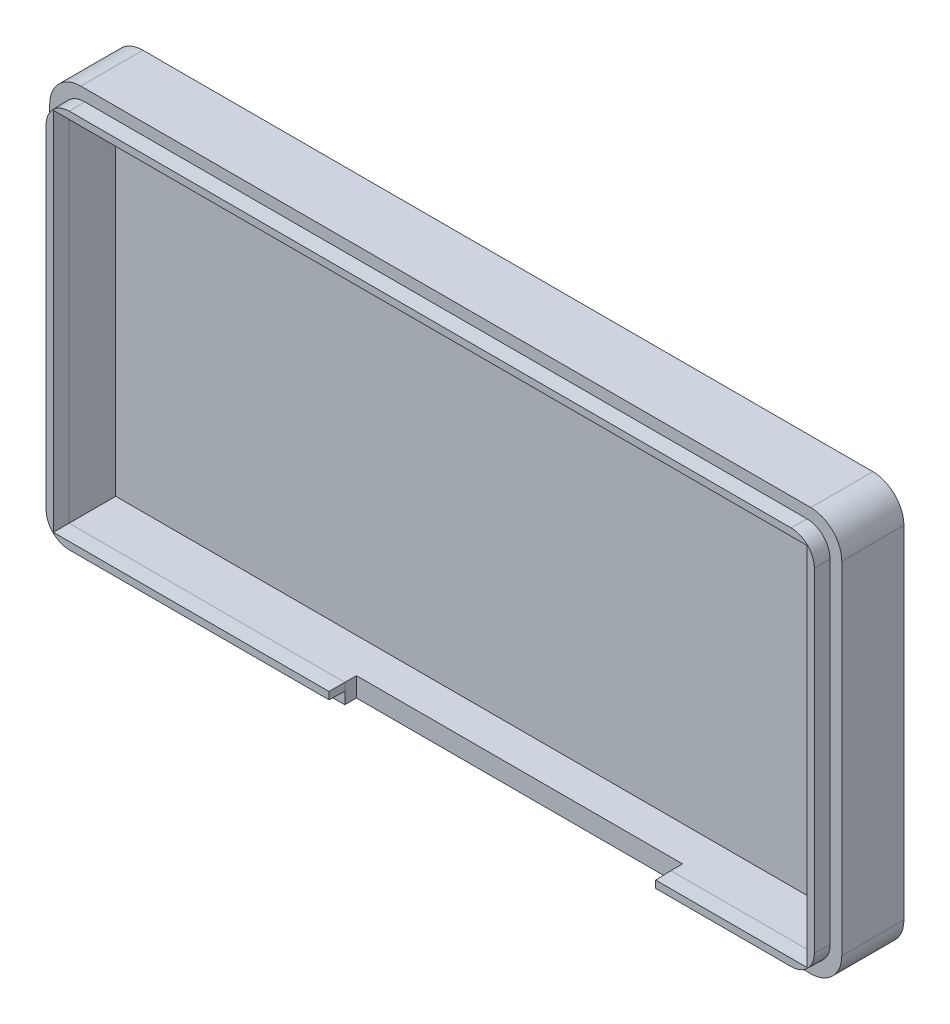
ISO-10303-21;
HEADER;
FILE_DESCRIPTION(('STEP AP214'),'2;1');
FILE_NAME('part.step','',(''),(''),'','','');
FILE_SCHEMA(('AUTOMOTIVE_DESIGN { 1 0 10303 214 1 1 1 1 }'));
ENDSEC;
DATA;
#1=APPLICATION_CONTEXT('core data for automotive mechanical design processes');
#2=APPLICATION_PROTOCOL_DEFINITION('international standard','automotive_design',2000,#1);
#3=PRODUCT_CONTEXT('',#1,'mechanical');
#4=PRODUCT('Part','Part','',(#3));
#5=PRODUCT_RELATED_PRODUCT_CATEGORY('part','',(#4));
#6=PRODUCT_DEFINITION_FORMATION('','',#4);
#7=PRODUCT_DEFINITION_CONTEXT('part definition',#1,'design');
#8=PRODUCT_DEFINITION('design','',#6,#7);
#9=PRODUCT_DEFINITION_SHAPE('','',#8);
#10=(LENGTH_UNIT() NAMED_UNIT(*) SI_UNIT(.MILLI.,.METRE.));
#11=(NAMED_UNIT(*) PLANE_ANGLE_UNIT() SI_UNIT($,.RADIAN.));
#12=(NAMED_UNIT(*) SI_UNIT($,.STERADIAN.) SOLID_ANGLE_UNIT());
#13=UNCERTAINTY_MEASURE_WITH_UNIT(LENGTH_MEASURE(1.E-05),#10,'distance_accuracy_value','');
#14=(GEOMETRIC_REPRESENTATION_CONTEXT(3) GLOBAL_UNCERTAINTY_ASSIGNED_CONTEXT((#13)) GLOBAL_UNIT_ASSIGNED_CONTEXT((#10,
#11,#12)) REPRESENTATION_CONTEXT('',''));
#15=CARTESIAN_POINT('',(0.,0.,0.));
#16=DIRECTION('',(0.,0.,1.));
#17=DIRECTION('',(1.,0.,0.));
#18=AXIS2_PLACEMENT_3D('',#15,#16,#17);
#19=CARTESIAN_POINT('',(0.,0.,8.));
#20=DIRECTION('',(0.,0.,1.));
#21=DIRECTION('',(1.,0.,0.));
#22=AXIS2_PLACEMENT_3D('',#19,#20,#21);
#23=PLANE('',#22);
#24=DIRECTION('',(0.,1.,0.));
#25=VECTOR('',#24,1.);
#26=CARTESIAN_POINT('',(38.,0.,8.));
#27=LINE('',#26,#25);
#28=CARTESIAN_POINT('',(38.,0.,8.));
#29=VERTEX_POINT('',#28);
#30=CARTESIAN_POINT('',(38.,1.5,8.));
#31=VERTEX_POINT('',#30);
#32=EDGE_CURVE('E426',#29,#31,#27,.T.);
#33=ORIENTED_EDGE('',*,*,#32,.T.);
#34=DIRECTION('',(1.,0.,0.));
#35=VECTOR('',#34,1.);
#36=CARTESIAN_POINT('',(38.,1.5,8.));
#37=LINE('',#36,#35);
#38=CARTESIAN_POINT('',(4.49954308546917,1.5,8.));
#39=VERTEX_POINT('',#38);
#40=EDGE_CURVE('E953',#31,#39,#37,.F.);
#41=ORIENTED_EDGE('',*,*,#40,.T.);
#42=CARTESIAN_POINT('',(4.50045698413172,4.50045698413172,8.));
#43=DIRECTION('',(0.,0.,1.));
#44=DIRECTION('',(-0.707106781186547,-0.707106781186548,0.));
#45=AXIS2_PLACEMENT_3D('',#42,#43,#44);
#46=ELLIPSE('',#45,3.00091389867315,3.);
#47=CARTESIAN_POINT('',(1.5,4.49954308546917,8.));
#48=VERTEX_POINT('',#47);
#49=EDGE_CURVE('E343',#39,#48,#46,.F.);
#50=ORIENTED_EDGE('',*,*,#49,.T.);
#51=DIRECTION('',(0.,1.,0.));
#52=VECTOR('',#51,1.);
#53=CARTESIAN_POINT('',(1.5,2.5,8.));
#54=LINE('',#53,#52);
#55=CARTESIAN_POINT('',(1.49999999999997,47.5004569145308,8.));
#56=VERTEX_POINT('',#55);
#57=EDGE_CURVE('E956',#48,#56,#54,.T.);
#58=ORIENTED_EDGE('',*,*,#57,.T.);
#59=CARTESIAN_POINT('',(4.5004569841317,47.4995430158683,8.));
#60=DIRECTION('',(0.,0.,1.));
#61=DIRECTION('',(-0.707106781186548,0.707106781186547,0.));
#62=AXIS2_PLACEMENT_3D('',#59,#60,#61);
#63=ELLIPSE('',#62,3.00091389867315,3.);
#64=CARTESIAN_POINT('',(4.49954308546915,50.5,8.));
#65=VERTEX_POINT('',#64);
#66=EDGE_CURVE('E346',#56,#65,#63,.F.);
#67=ORIENTED_EDGE('',*,*,#66,.T.);
#68=DIRECTION('',(1.,0.,0.));
#69=VECTOR('',#68,1.);
#70=CARTESIAN_POINT('',(2.49999999999997,50.5,8.));
#71=LINE('',#70,#69);
#72=CARTESIAN_POINT('',(97.5004569145308,50.5,8.));
#73=VERTEX_POINT('',#72);
#74=EDGE_CURVE('E354',#65,#73,#71,.T.);
#75=ORIENTED_EDGE('',*,*,#74,.T.);
#76=CARTESIAN_POINT('',(97.4995430158683,47.4995430158683,8.));
#77=DIRECTION('',(0.,0.,1.));
#78=DIRECTION('',(0.707106781186547,0.707106781186548,0.));
#79=AXIS2_PLACEMENT_3D('',#76,#77,#78);
#80=ELLIPSE('',#79,3.00091389867315,3.);
#81=CARTESIAN_POINT('',(100.5,47.5004569145308,8.));
#82=VERTEX_POINT('',#81);
#83=EDGE_CURVE('E72',#73,#82,#80,.F.);
#84=ORIENTED_EDGE('',*,*,#83,.T.);
#85=DIRECTION('',(0.,-1.,0.));
#86=VECTOR('',#85,1.);
#87=CARTESIAN_POINT('',(100.5,49.5,8.));
#88=LINE('',#87,#86);
#89=CARTESIAN_POINT('',(100.5,4.49954308546917,8.));
#90=VERTEX_POINT('',#89);
#91=EDGE_CURVE('E352',#82,#90,#88,.T.);
#92=ORIENTED_EDGE('',*,*,#91,.T.);
#93=CARTESIAN_POINT('',(97.4995430158683,4.50045698413173,8.));
#94=DIRECTION('',(0.,0.,1.));
#95=DIRECTION('',(0.707106781186548,-0.707106781186547,0.));
#96=AXIS2_PLACEMENT_3D('',#93,#94,#95);
#97=ELLIPSE('',#96,3.00091389867315,3.);
#98=CARTESIAN_POINT('',(97.5004569145308,1.5,8.));
#99=VERTEX_POINT('',#98);
#100=EDGE_CURVE('E12',#90,#99,#97,.F.);
#101=ORIENTED_EDGE('',*,*,#100,.T.);
#102=DIRECTION('',(1.,0.,0.));
#103=VECTOR('',#102,1.);
#104=CARTESIAN_POINT('',(99.5,1.5,8.));
#105=LINE('',#104,#103);
#106=CARTESIAN_POINT('',(80.,1.5,8.));
#107=VERTEX_POINT('',#106);
#108=EDGE_CURVE('E363',#99,#107,#105,.F.);
#109=ORIENTED_EDGE('',*,*,#108,.T.);
#110=DIRECTION('',(0.,-1.,0.));
#111=VECTOR('',#110,1.);
#112=CARTESIAN_POINT('',(80.,0.,8.));
#113=LINE('',#112,#111);
#114=CARTESIAN_POINT('',(80.,0.,8.));
#115=VERTEX_POINT('',#114);
#116=EDGE_CURVE('E288',#107,#115,#113,.T.);
#117=ORIENTED_EDGE('',*,*,#116,.T.);
#118=DIRECTION('',(1.,0.,0.));
#119=VECTOR('',#118,1.);
#120=CARTESIAN_POINT('',(0.,0.,8.));
#121=LINE('',#120,#119);
#122=CARTESIAN_POINT('',(98.,0.,8.));
#123=VERTEX_POINT('',#122);
#124=EDGE_CURVE('E478',#115,#123,#121,.T.);
#125=ORIENTED_EDGE('',*,*,#124,.T.);
#126=CARTESIAN_POINT('',(98.,4.,8.));
#127=DIRECTION('',(0.,0.,1.));
#128=DIRECTION('',(1.,0.,0.));
#129=AXIS2_PLACEMENT_3D('',#126,#127,#128);
#130=CIRCLE('',#129,4.);
#131=CARTESIAN_POINT('',(102.,4.,8.));
#132=VERTEX_POINT('',#131);
#133=EDGE_CURVE('E529',#123,#132,#130,.T.);
#134=ORIENTED_EDGE('',*,*,#133,.T.);
#135=DIRECTION('',(0.,1.,0.));
#136=VECTOR('',#135,1.);
#137=CARTESIAN_POINT('',(102.,0.,8.));
#138=LINE('',#137,#136);
#139=CARTESIAN_POINT('',(102.,48.,8.));
#140=VERTEX_POINT('',#139);
#141=EDGE_CURVE('E483',#132,#140,#138,.T.);
#142=ORIENTED_EDGE('',*,*,#141,.T.);
#143=CARTESIAN_POINT('',(98.,48.,8.));
#144=DIRECTION('',(0.,0.,1.));
#145=DIRECTION('',(1.,0.,0.));
#146=AXIS2_PLACEMENT_3D('',#143,#144,#145);
#147=CIRCLE('',#146,4.);
#148=CARTESIAN_POINT('',(98.,52.,8.));
#149=VERTEX_POINT('',#148);
#150=EDGE_CURVE('E538',#140,#149,#147,.T.);
#151=ORIENTED_EDGE('',*,*,#150,.T.);
#152=DIRECTION('',(-1.,0.,0.));
#153=VECTOR('',#152,1.);
#154=CARTESIAN_POINT('',(102.,52.,8.));
#155=LINE('',#154,#153);
#156=CARTESIAN_POINT('',(3.99999999999998,52.,8.));
#157=VERTEX_POINT('',#156);
#158=EDGE_CURVE('E470',#149,#157,#155,.T.);
#159=ORIENTED_EDGE('',*,*,#158,.T.);
#160=CARTESIAN_POINT('',(3.99999999999997,48.,8.));
#161=DIRECTION('',(0.,0.,1.));
#162=DIRECTION('',(1.,0.,0.));
#163=AXIS2_PLACEMENT_3D('',#160,#161,#162);
#164=CIRCLE('',#163,4.);
#165=CARTESIAN_POINT('',(0.,48.,8.));
#166=VERTEX_POINT('',#165);
#167=EDGE_CURVE('E535',#157,#166,#164,.T.);
#168=ORIENTED_EDGE('',*,*,#167,.T.);
#169=DIRECTION('',(0.,-1.,0.));
#170=VECTOR('',#169,1.);
#171=CARTESIAN_POINT('',(0.,52.,8.));
#172=LINE('',#171,#170);
#173=CARTESIAN_POINT('',(0.,4.00000000000001,8.));
#174=VERTEX_POINT('',#173);
#175=EDGE_CURVE('E474',#166,#174,#172,.T.);
#176=ORIENTED_EDGE('',*,*,#175,.T.);
#177=CARTESIAN_POINT('',(4.,4.,8.));
#178=DIRECTION('',(0.,0.,1.));
#179=DIRECTION('',(1.,0.,0.));
#180=AXIS2_PLACEMENT_3D('',#177,#178,#179);
#181=CIRCLE('',#180,4.);
#182=CARTESIAN_POINT('',(4.,0.,8.));
#183=VERTEX_POINT('',#182);
#184=EDGE_CURVE('E532',#174,#183,#181,.T.);
#185=ORIENTED_EDGE('',*,*,#184,.T.);
#186=EDGE_CURVE('E479',#183,#29,#121,.T.);
#187=ORIENTED_EDGE('',*,*,#186,.T.);
#188=EDGE_LOOP('',(#33,#41,#50,#58,#67,#75,#84,#92,#101,#109,#117,#125,#134,#142,#151,#159,#168,
#176,#185,#187));
#189=FACE_BOUND('',#188,.T.);
#190=ADVANCED_FACE('F63',(#189),#23,.T.);
#191=CARTESIAN_POINT('',(0.,0.,2.));
#192=DIRECTION('',(0.,1.,0.));
#193=DIRECTION('',(0.,0.,1.));
#194=AXIS2_PLACEMENT_3D('',#191,#192,#193);
#195=PLANE('',#194);
#196=DIRECTION('',(0.,0.,-1.));
#197=VECTOR('',#196,1.);
#198=CARTESIAN_POINT('',(80.,0.,29.3243963807178));
#199=LINE('',#198,#197);
#200=CARTESIAN_POINT('',(80.,0.,6.5));
#201=VERTEX_POINT('',#200);
#202=EDGE_CURVE('E266',#115,#201,#199,.T.);
#203=ORIENTED_EDGE('',*,*,#202,.T.);
#204=DIRECTION('',(-1.,0.,0.));
#205=VECTOR('',#204,1.);
#206=CARTESIAN_POINT('',(80.,0.,6.5));
#207=LINE('',#206,#205);
#208=CARTESIAN_POINT('',(38.,0.,6.5));
#209=VERTEX_POINT('',#208);
#210=EDGE_CURVE('E412',#201,#209,#207,.T.);
#211=ORIENTED_EDGE('',*,*,#210,.T.);
#212=DIRECTION('',(0.,0.,1.));
#213=VECTOR('',#212,1.);
#214=CARTESIAN_POINT('',(38.,0.,29.3243963807178));
#215=LINE('',#214,#213);
#216=EDGE_CURVE('E416',#209,#29,#215,.T.);
#217=ORIENTED_EDGE('',*,*,#216,.T.);
#218=ORIENTED_EDGE('',*,*,#186,.F.);
#219=DIRECTION('',(0.,0.,-1.));
#220=VECTOR('',#219,1.);
#221=CARTESIAN_POINT('',(4.,0.,2.));
#222=LINE('',#221,#220);
#223=CARTESIAN_POINT('',(4.,0.,0.));
#224=VERTEX_POINT('',#223);
#225=EDGE_CURVE('E552',#183,#224,#222,.T.);
#226=ORIENTED_EDGE('',*,*,#225,.T.);
#227=DIRECTION('',(1.,0.,0.));
#228=VECTOR('',#227,1.);
#229=CARTESIAN_POINT('',(0.,0.,0.));
#230=LINE('',#229,#228);
#231=CARTESIAN_POINT('',(98.,0.,0.));
#232=VERTEX_POINT('',#231);
#233=EDGE_CURVE('E491',#224,#232,#230,.T.);
#234=ORIENTED_EDGE('',*,*,#233,.T.);
#235=DIRECTION('',(0.,0.,-1.));
#236=VECTOR('',#235,1.);
#237=CARTESIAN_POINT('',(98.,0.,2.));
#238=LINE('',#237,#236);
#239=EDGE_CURVE('E548',#232,#123,#238,.F.);
#240=ORIENTED_EDGE('',*,*,#239,.T.);
#241=ORIENTED_EDGE('',*,*,#124,.F.);
#242=EDGE_LOOP('',(#203,#211,#217,#218,#226,#234,#240,#241));
#243=FACE_BOUND('',#242,.T.);
#244=ADVANCED_FACE('F569',(#243),#195,.F.);
#245=CARTESIAN_POINT('',(0.,2.5,8.));
#246=DIRECTION('',(0.,1.,0.));
#247=DIRECTION('',(0.,0.,1.));
#248=AXIS2_PLACEMENT_3D('',#245,#246,#247);
#249=PLANE('',#248);
#250=DIRECTION('',(1.,0.,0.));
#251=VECTOR('',#250,1.);
#252=CARTESIAN_POINT('',(0.,2.5,6.5));
#253=LINE('',#252,#251);
#254=CARTESIAN_POINT('',(38.,2.5,6.5));
#255=VERTEX_POINT('',#254);
#256=CARTESIAN_POINT('',(80.,2.5,6.5));
#257=VERTEX_POINT('',#256);
#258=EDGE_CURVE('E296',#255,#257,#253,.T.);
#259=ORIENTED_EDGE('',*,*,#258,.T.);
#260=DIRECTION('',(0.,0.,1.));
#261=VECTOR('',#260,1.);
#262=CARTESIAN_POINT('',(80.,2.5,8.));
#263=LINE('',#262,#261);
#264=CARTESIAN_POINT('',(80.,2.5,8.));
#265=VERTEX_POINT('',#264);
#266=EDGE_CURVE('E285',#257,#265,#263,.T.);
#267=ORIENTED_EDGE('',*,*,#266,.T.);
#268=DIRECTION('',(1.,0.,0.));
#269=VECTOR('',#268,1.);
#270=CARTESIAN_POINT('',(0.,2.5,8.));
#271=LINE('',#270,#269);
#272=CARTESIAN_POINT('',(99.5,2.5,8.));
#273=VERTEX_POINT('',#272);
#274=EDGE_CURVE('E271',#265,#273,#271,.T.);
#275=ORIENTED_EDGE('',*,*,#274,.T.);
#276=DIRECTION('',(0.,0.,-1.));
#277=VECTOR('',#276,1.);
#278=CARTESIAN_POINT('',(99.5,2.5,8.));
#279=LINE('',#278,#277);
#280=CARTESIAN_POINT('',(99.5,2.5,2.));
#281=VERTEX_POINT('',#280);
#282=EDGE_CURVE('E460',#273,#281,#279,.T.);
#283=ORIENTED_EDGE('',*,*,#282,.T.);
#284=DIRECTION('',(1.,0.,0.));
#285=VECTOR('',#284,1.);
#286=CARTESIAN_POINT('',(0.,2.5,2.));
#287=LINE('',#286,#285);
#288=CARTESIAN_POINT('',(2.5,2.5,2.));
#289=VERTEX_POINT('',#288);
#290=EDGE_CURVE('E451',#289,#281,#287,.T.);
#291=ORIENTED_EDGE('',*,*,#290,.F.);
#292=DIRECTION('',(0.,0.,-1.));
#293=VECTOR('',#292,1.);
#294=CARTESIAN_POINT('',(2.5,2.5,8.));
#295=LINE('',#294,#293);
#296=CARTESIAN_POINT('',(2.5,2.5,8.));
#297=VERTEX_POINT('',#296);
#298=EDGE_CURVE('E463',#297,#289,#295,.T.);
#299=ORIENTED_EDGE('',*,*,#298,.F.);
#300=CARTESIAN_POINT('',(38.,2.5,8.));
#301=VERTEX_POINT('',#300);
#302=EDGE_CURVE('E279',#297,#301,#271,.T.);
#303=ORIENTED_EDGE('',*,*,#302,.T.);
#304=DIRECTION('',(0.,0.,-1.));
#305=VECTOR('',#304,1.);
#306=CARTESIAN_POINT('',(38.,2.5,8.));
#307=LINE('',#306,#305);
#308=EDGE_CURVE('E305',#301,#255,#307,.T.);
#309=ORIENTED_EDGE('',*,*,#308,.T.);
#310=EDGE_LOOP('',(#259,#267,#275,#283,#291,#299,#303,#309));
#311=FACE_BOUND('',#310,.T.);
#312=ADVANCED_FACE('F293',(#311),#249,.T.);
#313=CARTESIAN_POINT('',(0.,0.,2.));
#314=DIRECTION('',(1.,0.,0.));
#315=DIRECTION('',(0.,1.,0.));
#316=AXIS2_PLACEMENT_3D('',#313,#314,#315);
#317=PLANE('',#316);
#318=ORIENTED_EDGE('',*,*,#175,.F.);
#319=DIRECTION('',(0.,0.,-1.));
#320=VECTOR('',#319,1.);
#321=CARTESIAN_POINT('',(0.,48.,2.));
#322=LINE('',#321,#320);
#323=CARTESIAN_POINT('',(0.,48.,0.));
#324=VERTEX_POINT('',#323);
#325=EDGE_CURVE('E544',#166,#324,#322,.T.);
#326=ORIENTED_EDGE('',*,*,#325,.T.);
#327=DIRECTION('',(0.,-1.,0.));
#328=VECTOR('',#327,1.);
#329=CARTESIAN_POINT('',(0.,0.,0.));
#330=LINE('',#329,#328);
#331=CARTESIAN_POINT('',(0.,4.,0.));
#332=VERTEX_POINT('',#331);
#333=EDGE_CURVE('E487',#324,#332,#330,.T.);
#334=ORIENTED_EDGE('',*,*,#333,.T.);
#335=DIRECTION('',(0.,0.,-1.));
#336=VECTOR('',#335,1.);
#337=CARTESIAN_POINT('',(0.,4.,2.));
#338=LINE('',#337,#336);
#339=EDGE_CURVE('E541',#332,#174,#338,.F.);
#340=ORIENTED_EDGE('',*,*,#339,.T.);
#341=EDGE_LOOP('',(#318,#326,#334,#340));
#342=FACE_BOUND('',#341,.T.);
#343=ADVANCED_FACE('F663',(#342),#317,.F.);
#344=CARTESIAN_POINT('',(102.,0.,2.));
#345=DIRECTION('',(-1.,0.,0.));
#346=DIRECTION('',(0.,-1.,0.));
#347=AXIS2_PLACEMENT_3D('',#344,#345,#346);
#348=PLANE('',#347);
#349=DIRECTION('',(0.,1.,0.));
#350=VECTOR('',#349,1.);
#351=CARTESIAN_POINT('',(102.,0.,0.));
#352=LINE('',#351,#350);
#353=CARTESIAN_POINT('',(102.,4.,0.));
#354=VERTEX_POINT('',#353);
#355=CARTESIAN_POINT('',(102.,48.,0.));
#356=VERTEX_POINT('',#355);
#357=EDGE_CURVE('E495',#354,#356,#352,.T.);
#358=ORIENTED_EDGE('',*,*,#357,.T.);
#359=DIRECTION('',(0.,0.,-1.));
#360=VECTOR('',#359,1.);
#361=CARTESIAN_POINT('',(102.,48.,2.));
#362=LINE('',#361,#360);
#363=EDGE_CURVE('E526',#356,#140,#362,.F.);
#364=ORIENTED_EDGE('',*,*,#363,.T.);
#365=ORIENTED_EDGE('',*,*,#141,.F.);
#366=DIRECTION('',(0.,0.,-1.));
#367=VECTOR('',#366,1.);
#368=CARTESIAN_POINT('',(102.,4.,2.));
#369=LINE('',#368,#367);
#370=EDGE_CURVE('E522',#132,#354,#369,.T.);
#371=ORIENTED_EDGE('',*,*,#370,.T.);
#372=EDGE_LOOP('',(#358,#364,#365,#371));
#373=FACE_BOUND('',#372,.T.);
#374=ADVANCED_FACE('F660',(#373),#348,.F.);
#375=CARTESIAN_POINT('',(0.,52.,2.));
#376=DIRECTION('',(0.,-1.,0.));
#377=DIRECTION('',(0.,0.,-1.));
#378=AXIS2_PLACEMENT_3D('',#375,#376,#377);
#379=PLANE('',#378);
#380=ORIENTED_EDGE('',*,*,#158,.F.);
#381=DIRECTION('',(0.,0.,-1.));
#382=VECTOR('',#381,1.);
#383=CARTESIAN_POINT('',(98.,52.,2.));
#384=LINE('',#383,#382);
#385=CARTESIAN_POINT('',(98.,52.,0.));
#386=VERTEX_POINT('',#385);
#387=EDGE_CURVE('E506',#149,#386,#384,.T.);
#388=ORIENTED_EDGE('',*,*,#387,.T.);
#389=DIRECTION('',(-1.,0.,0.));
#390=VECTOR('',#389,1.);
#391=CARTESIAN_POINT('',(0.,52.,0.));
#392=LINE('',#391,#390);
#393=CARTESIAN_POINT('',(3.99999999999997,52.,0.));
#394=VERTEX_POINT('',#393);
#395=EDGE_CURVE('E499',#386,#394,#392,.T.);
#396=ORIENTED_EDGE('',*,*,#395,.T.);
#397=DIRECTION('',(0.,0.,-1.));
#398=VECTOR('',#397,1.);
#399=CARTESIAN_POINT('',(3.99999999999997,52.,2.));
#400=LINE('',#399,#398);
#401=EDGE_CURVE('E503',#394,#157,#400,.F.);
#402=ORIENTED_EDGE('',*,*,#401,.T.);
#403=EDGE_LOOP('',(#380,#388,#396,#402));
#404=FACE_BOUND('',#403,.T.);
#405=ADVANCED_FACE('F656',(#404),#379,.F.);
#406=CARTESIAN_POINT('',(0.,0.,0.));
#407=DIRECTION('',(0.,0.,-1.));
#408=DIRECTION('',(-1.,0.,0.));
#409=AXIS2_PLACEMENT_3D('',#406,#407,#408);
#410=PLANE('',#409);
#411=ORIENTED_EDGE('',*,*,#395,.F.);
#412=CARTESIAN_POINT('',(98.,48.,0.));
#413=DIRECTION('',(0.,0.,-1.));
#414=DIRECTION('',(-1.,0.,0.));
#415=AXIS2_PLACEMENT_3D('',#412,#413,#414);
#416=CIRCLE('',#415,4.);
#417=EDGE_CURVE('E519',#386,#356,#416,.T.);
#418=ORIENTED_EDGE('',*,*,#417,.T.);
#419=ORIENTED_EDGE('',*,*,#357,.F.);
#420=CARTESIAN_POINT('',(98.,4.,0.));
#421=DIRECTION('',(0.,0.,-1.));
#422=DIRECTION('',(-1.,0.,0.));
#423=AXIS2_PLACEMENT_3D('',#420,#421,#422);
#424=CIRCLE('',#423,4.);
#425=EDGE_CURVE('E510',#354,#232,#424,.T.);
#426=ORIENTED_EDGE('',*,*,#425,.T.);
#427=ORIENTED_EDGE('',*,*,#233,.F.);
#428=CARTESIAN_POINT('',(4.,4.,0.));
#429=DIRECTION('',(0.,0.,-1.));
#430=DIRECTION('',(-1.,0.,0.));
#431=AXIS2_PLACEMENT_3D('',#428,#429,#430);
#432=CIRCLE('',#431,4.);
#433=EDGE_CURVE('E513',#224,#332,#432,.T.);
#434=ORIENTED_EDGE('',*,*,#433,.T.);
#435=ORIENTED_EDGE('',*,*,#333,.F.);
#436=CARTESIAN_POINT('',(3.99999999999997,48.,0.));
#437=DIRECTION('',(0.,0.,-1.));
#438=DIRECTION('',(-1.,0.,0.));
#439=AXIS2_PLACEMENT_3D('',#436,#437,#438);
#440=CIRCLE('',#439,4.);
#441=EDGE_CURVE('E516',#324,#394,#440,.T.);
#442=ORIENTED_EDGE('',*,*,#441,.T.);
#443=EDGE_LOOP('',(#411,#418,#419,#426,#427,#434,#435,#442));
#444=FACE_BOUND('',#443,.T.);
#445=ADVANCED_FACE('F653',(#444),#410,.T.);
#446=CARTESIAN_POINT('',(102.,49.5,8.));
#447=DIRECTION('',(0.,-1.,0.));
#448=DIRECTION('',(0.,0.,-1.));
#449=AXIS2_PLACEMENT_3D('',#446,#447,#448);
#450=PLANE('',#449);
#451=DIRECTION('',(-1.,0.,0.));
#452=VECTOR('',#451,1.);
#453=CARTESIAN_POINT('',(102.,49.5,2.));
#454=LINE('',#453,#452);
#455=CARTESIAN_POINT('',(99.5,49.5,2.));
#456=VERTEX_POINT('',#455);
#457=CARTESIAN_POINT('',(2.49999999999997,49.5,2.));
#458=VERTEX_POINT('',#457);
#459=EDGE_CURVE('E290',#456,#458,#454,.T.);
#460=ORIENTED_EDGE('',*,*,#459,.F.);
#461=DIRECTION('',(0.,0.,-1.));
#462=VECTOR('',#461,1.);
#463=CARTESIAN_POINT('',(99.5,49.5,8.));
#464=LINE('',#463,#462);
#465=CARTESIAN_POINT('',(99.5,49.5,8.));
#466=VERTEX_POINT('',#465);
#467=EDGE_CURVE('E443',#466,#456,#464,.T.);
#468=ORIENTED_EDGE('',*,*,#467,.F.);
#469=DIRECTION('',(-1.,0.,0.));
#470=VECTOR('',#469,1.);
#471=CARTESIAN_POINT('',(102.,49.5,8.));
#472=LINE('',#471,#470);
#473=CARTESIAN_POINT('',(2.49999999999997,49.5,8.));
#474=VERTEX_POINT('',#473);
#475=EDGE_CURVE('E429',#466,#474,#472,.T.);
#476=ORIENTED_EDGE('',*,*,#475,.T.);
#477=DIRECTION('',(0.,0.,-1.));
#478=VECTOR('',#477,1.);
#479=CARTESIAN_POINT('',(2.49999999999997,49.5,8.));
#480=LINE('',#479,#478);
#481=EDGE_CURVE('E466',#474,#458,#480,.T.);
#482=ORIENTED_EDGE('',*,*,#481,.T.);
#483=EDGE_LOOP('',(#460,#468,#476,#482));
#484=FACE_BOUND('',#483,.T.);
#485=ADVANCED_FACE('F618',(#484),#450,.T.);
#486=CARTESIAN_POINT('',(2.49999999999997,52.,8.));
#487=DIRECTION('',(1.,0.,0.));
#488=DIRECTION('',(0.,1.,0.));
#489=AXIS2_PLACEMENT_3D('',#486,#487,#488);
#490=PLANE('',#489);
#491=DIRECTION('',(0.,-1.,0.));
#492=VECTOR('',#491,1.);
#493=CARTESIAN_POINT('',(2.49999999999997,52.,2.));
#494=LINE('',#493,#492);
#495=EDGE_CURVE('E447',#458,#289,#494,.T.);
#496=ORIENTED_EDGE('',*,*,#495,.F.);
#497=ORIENTED_EDGE('',*,*,#481,.F.);
#498=DIRECTION('',(0.,-1.,0.));
#499=VECTOR('',#498,1.);
#500=CARTESIAN_POINT('',(2.49999999999997,52.,8.));
#501=LINE('',#500,#499);
#502=EDGE_CURVE('E280',#474,#297,#501,.T.);
#503=ORIENTED_EDGE('',*,*,#502,.T.);
#504=ORIENTED_EDGE('',*,*,#298,.T.);
#505=EDGE_LOOP('',(#496,#497,#503,#504));
#506=FACE_BOUND('',#505,.T.);
#507=ADVANCED_FACE('F624',(#506),#490,.T.);
#508=CARTESIAN_POINT('',(99.5,0.,8.));
#509=DIRECTION('',(-1.,0.,0.));
#510=DIRECTION('',(0.,-1.,0.));
#511=AXIS2_PLACEMENT_3D('',#508,#509,#510);
#512=PLANE('',#511);
#513=DIRECTION('',(0.,1.,0.));
#514=VECTOR('',#513,1.);
#515=CARTESIAN_POINT('',(99.5,0.,2.));
#516=LINE('',#515,#514);
#517=EDGE_CURVE('E433',#281,#456,#516,.T.);
#518=ORIENTED_EDGE('',*,*,#517,.F.);
#519=ORIENTED_EDGE('',*,*,#282,.F.);
#520=DIRECTION('',(0.,1.,0.));
#521=VECTOR('',#520,1.);
#522=CARTESIAN_POINT('',(99.5,0.,8.));
#523=LINE('',#522,#521);
#524=EDGE_CURVE('E439',#273,#466,#523,.T.);
#525=ORIENTED_EDGE('',*,*,#524,.T.);
#526=ORIENTED_EDGE('',*,*,#467,.T.);
#527=EDGE_LOOP('',(#518,#519,#525,#526));
#528=FACE_BOUND('',#527,.T.);
#529=ADVANCED_FACE('F615',(#528),#512,.T.);
#530=CARTESIAN_POINT('',(0.,0.,2.));
#531=DIRECTION('',(0.,0.,-1.));
#532=DIRECTION('',(-1.,0.,0.));
#533=AXIS2_PLACEMENT_3D('',#530,#531,#532);
#534=PLANE('',#533);
#535=ORIENTED_EDGE('',*,*,#517,.T.);
#536=ORIENTED_EDGE('',*,*,#459,.T.);
#537=ORIENTED_EDGE('',*,*,#495,.T.);
#538=ORIENTED_EDGE('',*,*,#290,.T.);
#539=EDGE_LOOP('',(#535,#536,#537,#538));
#540=FACE_BOUND('',#539,.T.);
#541=ADVANCED_FACE('F621',(#540),#534,.F.);
#542=CARTESIAN_POINT('',(98.,48.,2.));
#543=DIRECTION('',(0.,0.,-1.));
#544=DIRECTION('',(-1.,0.,0.));
#545=AXIS2_PLACEMENT_3D('',#542,#543,#544);
#546=CYLINDRICAL_SURFACE('',#545,4.);
#547=ORIENTED_EDGE('',*,*,#150,.F.);
#548=ORIENTED_EDGE('',*,*,#363,.F.);
#549=ORIENTED_EDGE('',*,*,#417,.F.);
#550=ORIENTED_EDGE('',*,*,#387,.F.);
#551=EDGE_LOOP('',(#547,#548,#549,#550));
#552=FACE_BOUND('',#551,.T.);
#553=ADVANCED_FACE('F652',(#552),#546,.T.);
#554=CARTESIAN_POINT('',(3.99999999999997,48.,2.));
#555=DIRECTION('',(0.,0.,-1.));
#556=DIRECTION('',(-1.,0.,0.));
#557=AXIS2_PLACEMENT_3D('',#554,#555,#556);
#558=CYLINDRICAL_SURFACE('',#557,4.);
#559=ORIENTED_EDGE('',*,*,#167,.F.);
#560=ORIENTED_EDGE('',*,*,#401,.F.);
#561=ORIENTED_EDGE('',*,*,#441,.F.);
#562=ORIENTED_EDGE('',*,*,#325,.F.);
#563=EDGE_LOOP('',(#559,#560,#561,#562));
#564=FACE_BOUND('',#563,.T.);
#565=ADVANCED_FACE('F671',(#564),#558,.T.);
#566=CARTESIAN_POINT('',(4.,4.,2.));
#567=DIRECTION('',(0.,0.,-1.));
#568=DIRECTION('',(-1.,0.,0.));
#569=AXIS2_PLACEMENT_3D('',#566,#567,#568);
#570=CYLINDRICAL_SURFACE('',#569,4.);
#571=ORIENTED_EDGE('',*,*,#184,.F.);
#572=ORIENTED_EDGE('',*,*,#339,.F.);
#573=ORIENTED_EDGE('',*,*,#433,.F.);
#574=ORIENTED_EDGE('',*,*,#225,.F.);
#575=EDGE_LOOP('',(#571,#572,#573,#574));
#576=FACE_BOUND('',#575,.T.);
#577=ADVANCED_FACE('F675',(#576),#570,.T.);
#578=CARTESIAN_POINT('',(98.,4.,2.));
#579=DIRECTION('',(0.,0.,-1.));
#580=DIRECTION('',(-1.,0.,0.));
#581=AXIS2_PLACEMENT_3D('',#578,#579,#580);
#582=CYLINDRICAL_SURFACE('',#581,4.);
#583=ORIENTED_EDGE('',*,*,#133,.F.);
#584=ORIENTED_EDGE('',*,*,#239,.F.);
#585=ORIENTED_EDGE('',*,*,#425,.F.);
#586=ORIENTED_EDGE('',*,*,#370,.F.);
#587=EDGE_LOOP('',(#583,#584,#585,#586));
#588=FACE_BOUND('',#587,.T.);
#589=ADVANCED_FACE('F679',(#588),#582,.T.);
#590=CARTESIAN_POINT('',(80.,14.,29.3243963807178));
#591=DIRECTION('',(-1.,0.,0.));
#592=DIRECTION('',(0.,0.,1.));
#593=AXIS2_PLACEMENT_3D('',#590,#591,#592);
#594=PLANE('',#593);
#595=ORIENTED_EDGE('',*,*,#266,.F.);
#596=DIRECTION('',(0.,-1.,0.));
#597=VECTOR('',#596,1.);
#598=CARTESIAN_POINT('',(80.,14.,6.5));
#599=LINE('',#598,#597);
#600=EDGE_CURVE('E423',#257,#201,#599,.T.);
#601=ORIENTED_EDGE('',*,*,#600,.T.);
#602=ORIENTED_EDGE('',*,*,#202,.F.);
#603=ORIENTED_EDGE('',*,*,#116,.F.);
#604=EDGE_CURVE('E259',#265,#107,#113,.T.);
#605=ORIENTED_EDGE('',*,*,#604,.F.);
#606=EDGE_LOOP('',(#595,#601,#602,#603,#605));
#607=FACE_BOUND('',#606,.T.);
#608=ADVANCED_FACE('F284',(#607),#594,.T.);
#609=CARTESIAN_POINT('',(80.,14.,6.5));
#610=DIRECTION('',(0.,0.,1.));
#611=DIRECTION('',(1.,0.,0.));
#612=AXIS2_PLACEMENT_3D('',#609,#610,#611);
#613=PLANE('',#612);
#614=DIRECTION('',(0.,-1.,0.));
#615=VECTOR('',#614,1.);
#616=CARTESIAN_POINT('',(38.,14.,6.5));
#617=LINE('',#616,#615);
#618=EDGE_CURVE('E420',#255,#209,#617,.T.);
#619=ORIENTED_EDGE('',*,*,#618,.T.);
#620=ORIENTED_EDGE('',*,*,#210,.F.);
#621=ORIENTED_EDGE('',*,*,#600,.F.);
#622=ORIENTED_EDGE('',*,*,#258,.F.);
#623=EDGE_LOOP('',(#619,#620,#621,#622));
#624=FACE_BOUND('',#623,.T.);
#625=ADVANCED_FACE('F566',(#624),#613,.T.);
#626=CARTESIAN_POINT('',(38.,14.,29.3243963807178));
#627=DIRECTION('',(1.,0.,0.));
#628=DIRECTION('',(0.,0.,-1.));
#629=AXIS2_PLACEMENT_3D('',#626,#627,#628);
#630=PLANE('',#629);
#631=ORIENTED_EDGE('',*,*,#216,.F.);
#632=ORIENTED_EDGE('',*,*,#618,.F.);
#633=ORIENTED_EDGE('',*,*,#308,.F.);
#634=DIRECTION('',(0.,-1.,0.));
#635=VECTOR('',#634,1.);
#636=CARTESIAN_POINT('',(38.,2.5,8.));
#637=LINE('',#636,#635);
#638=EDGE_CURVE('E563',#301,#31,#637,.T.);
#639=ORIENTED_EDGE('',*,*,#638,.T.);
#640=ORIENTED_EDGE('',*,*,#32,.F.);
#641=EDGE_LOOP('',(#631,#632,#633,#639,#640));
#642=FACE_BOUND('',#641,.T.);
#643=ADVANCED_FACE('F561',(#642),#630,.T.);
#644=CARTESIAN_POINT('',(99.5,2.5,8.));
#645=DIRECTION('',(0.,0.999847695156391,0.0174524064372835));
#646=DIRECTION('',(0.,-0.0174524064372835,0.999847695156391));
#647=AXIS2_PLACEMENT_3D('',#644,#645,#646);
#648=PLANE('',#647);
#649=ORIENTED_EDGE('',*,*,#274,.F.);
#650=DIRECTION('',(0.0174497491606827,-0.0174497491606827,0.999695459881887));
#651=VECTOR('',#650,1.);
#652=CARTESIAN_POINT('',(80.0059376280425,2.49406237195747,8.34016648273424));
#653=LINE('',#652,#651);
#654=CARTESIAN_POINT('',(80.0349101298564,2.46508987014357,10.));
#655=VERTEX_POINT('',#654);
#656=EDGE_CURVE('E254',#655,#265,#653,.F.);
#657=ORIENTED_EDGE('',*,*,#656,.F.);
#658=DIRECTION('',(1.,0.,0.));
#659=VECTOR('',#658,1.);
#660=CARTESIAN_POINT('',(0.,2.46508987014357,10.));
#661=LINE('',#660,#659);
#662=CARTESIAN_POINT('',(99.5349101298564,2.46508987014357,10.));
#663=VERTEX_POINT('',#662);
#664=EDGE_CURVE('E598',#663,#655,#661,.F.);
#665=ORIENTED_EDGE('',*,*,#664,.F.);
#666=DIRECTION('',(-0.0174497491606827,0.0174497491606827,-0.999695459881887));
#667=VECTOR('',#666,1.);
#668=CARTESIAN_POINT('',(99.4856887939488,2.51431120605122,7.18011155443542));
#669=LINE('',#668,#667);
#670=EDGE_CURVE('E274',#663,#273,#669,.T.);
#671=ORIENTED_EDGE('',*,*,#670,.T.);
#672=EDGE_LOOP('',(#649,#657,#665,#671));
#673=FACE_BOUND('',#672,.T.);
#674=ADVANCED_FACE('F272',(#673),#648,.T.);
#675=CARTESIAN_POINT('',(80.,1.5,8.));
#676=DIRECTION('',(-0.999847695156391,0.,0.0174524064372835));
#677=DIRECTION('',(0.0174524064372835,0.,0.999847695156391));
#678=AXIS2_PLACEMENT_3D('',#675,#676,#677);
#679=PLANE('',#678);
#680=ORIENTED_EDGE('',*,*,#604,.T.);
#681=DIRECTION('',(-0.0174497491606827,-0.0174497491606827,-0.999695459881887));
#682=VECTOR('',#681,1.);
#683=CARTESIAN_POINT('',(80.0059376280425,1.50593762804253,8.34016648273424));
#684=LINE('',#683,#682);
#685=CARTESIAN_POINT('',(80.0349101298564,1.53491012985644,10.));
#686=VERTEX_POINT('',#685);
#687=EDGE_CURVE('E267',#686,#107,#684,.T.);
#688=ORIENTED_EDGE('',*,*,#687,.F.);
#689=DIRECTION('',(0.,1.,0.));
#690=VECTOR('',#689,1.);
#691=CARTESIAN_POINT('',(80.0349101298564,0.,10.));
#692=LINE('',#691,#690);
#693=EDGE_CURVE('E262',#686,#655,#692,.T.);
#694=ORIENTED_EDGE('',*,*,#693,.T.);
#695=ORIENTED_EDGE('',*,*,#656,.T.);
#696=EDGE_LOOP('',(#680,#688,#694,#695));
#697=FACE_BOUND('',#696,.T.);
#698=ADVANCED_FACE('F256',(#697),#679,.T.);
#699=CARTESIAN_POINT('',(99.5,1.5,8.));
#700=DIRECTION('',(0.,-0.999847695156391,0.0174524064372835));
#701=DIRECTION('',(0.,-0.0174524064372835,-0.999847695156391));
#702=AXIS2_PLACEMENT_3D('',#699,#700,#701);
#703=PLANE('',#702);
#704=ORIENTED_EDGE('',*,*,#108,.F.);
#705=DIRECTION('',(0.0174497491606827,-0.0174497491606827,-0.999695459881888));
#706=VECTOR('',#705,1.);
#707=CARTESIAN_POINT('',(97.5010657628948,1.49939115163608,7.96511910059181));
#708=LINE('',#707,#706);
#709=CARTESIAN_POINT('',(97.4655467846744,1.53491012985644,10.));
#710=VERTEX_POINT('',#709);
#711=EDGE_CURVE('E340',#99,#710,#708,.F.);
#712=ORIENTED_EDGE('',*,*,#711,.T.);
#713=DIRECTION('',(-1.,0.,0.));
#714=VECTOR('',#713,1.);
#715=CARTESIAN_POINT('',(0.,1.53491012985644,10.));
#716=LINE('',#715,#714);
#717=EDGE_CURVE('E386',#710,#686,#716,.T.);
#718=ORIENTED_EDGE('',*,*,#717,.T.);
#719=ORIENTED_EDGE('',*,*,#687,.T.);
#720=EDGE_LOOP('',(#704,#712,#718,#719));
#721=FACE_BOUND('',#720,.T.);
#722=ADVANCED_FACE('F605',(#721),#703,.T.);
#723=CARTESIAN_POINT('',(100.5,49.5,8.));
#724=DIRECTION('',(0.999847695156391,0.,0.0174524064372835));
#725=DIRECTION('',(0.0174524064372835,0.,-0.999847695156391));
#726=AXIS2_PLACEMENT_3D('',#723,#724,#725);
#727=PLANE('',#726);
#728=ORIENTED_EDGE('',*,*,#91,.F.);
#729=DIRECTION('',(0.0174497491606827,0.0174497491606827,-0.999695459881888));
#730=VECTOR('',#729,1.);
#731=CARTESIAN_POINT('',(100.500608848364,47.5010657628947,7.96511910059181));
#732=LINE('',#731,#730);
#733=CARTESIAN_POINT('',(100.465089870144,47.4655467846744,10.));
#734=VERTEX_POINT('',#733);
#735=EDGE_CURVE('E337',#82,#734,#732,.F.);
#736=ORIENTED_EDGE('',*,*,#735,.T.);
#737=DIRECTION('',(0.,-1.,0.));
#738=VECTOR('',#737,1.);
#739=CARTESIAN_POINT('',(100.465089870144,0.,10.));
#740=LINE('',#739,#738);
#741=CARTESIAN_POINT('',(100.465089870144,4.53445321532561,10.));
#742=VERTEX_POINT('',#741);
#743=EDGE_CURVE('E374',#734,#742,#740,.T.);
#744=ORIENTED_EDGE('',*,*,#743,.T.);
#745=DIRECTION('',(0.0174497491606827,-0.0174497491606827,-0.999695459881888));
#746=VECTOR('',#745,1.);
#747=CARTESIAN_POINT('',(100.486297642313,4.51324544315648,8.78500754615639));
#748=LINE('',#747,#746);
#749=EDGE_CURVE('E334',#742,#90,#748,.T.);
#750=ORIENTED_EDGE('',*,*,#749,.T.);
#751=EDGE_LOOP('',(#728,#736,#744,#750));
#752=FACE_BOUND('',#751,.T.);
#753=ADVANCED_FACE('F359',(#752),#727,.T.);
#754=CARTESIAN_POINT('',(2.49999999999997,50.5,8.));
#755=DIRECTION('',(0.,0.999847695156391,0.0174524064372835));
#756=DIRECTION('',(0.,-0.0174524064372835,0.999847695156391));
#757=AXIS2_PLACEMENT_3D('',#754,#755,#756);
#758=PLANE('',#757);
#759=ORIENTED_EDGE('',*,*,#74,.F.);
#760=DIRECTION('',(-0.0174497491606827,0.0174497491606827,-0.999695459881888));
#761=VECTOR('',#760,1.);
#762=CARTESIAN_POINT('',(4.49893423710522,50.5006088483639,7.96511910059181));
#763=LINE('',#762,#761);
#764=CARTESIAN_POINT('',(4.53445321532558,50.4650898701436,10.));
#765=VERTEX_POINT('',#764);
#766=EDGE_CURVE('E331',#65,#765,#763,.F.);
#767=ORIENTED_EDGE('',*,*,#766,.T.);
#768=DIRECTION('',(1.,0.,0.));
#769=VECTOR('',#768,1.);
#770=CARTESIAN_POINT('',(0.,50.4650898701436,10.));
#771=LINE('',#770,#769);
#772=CARTESIAN_POINT('',(97.4655467846744,50.4650898701436,10.));
#773=VERTEX_POINT('',#772);
#774=EDGE_CURVE('E372',#765,#773,#771,.T.);
#775=ORIENTED_EDGE('',*,*,#774,.T.);
#776=DIRECTION('',(0.0174497491606827,0.0174497491606827,-0.999695459881888));
#777=VECTOR('',#776,1.);
#778=CARTESIAN_POINT('',(97.471529869555,50.4710729550242,9.65722929675701));
#779=LINE('',#778,#777);
#780=EDGE_CURVE('E327',#773,#73,#779,.T.);
#781=ORIENTED_EDGE('',*,*,#780,.T.);
#782=EDGE_LOOP('',(#759,#767,#775,#781));
#783=FACE_BOUND('',#782,.T.);
#784=ADVANCED_FACE('F376',(#783),#758,.T.);
#785=CARTESIAN_POINT('',(1.5,2.5,8.));
#786=DIRECTION('',(-0.999847695156391,0.,0.0174524064372835));
#787=DIRECTION('',(0.0174524064372835,0.,0.999847695156391));
#788=AXIS2_PLACEMENT_3D('',#785,#786,#787);
#789=PLANE('',#788);
#790=ORIENTED_EDGE('',*,*,#57,.F.);
#791=DIRECTION('',(-0.0174497491606827,-0.0174497491606827,-0.999695459881888));
#792=VECTOR('',#791,1.);
#793=CARTESIAN_POINT('',(1.49939115163607,4.49893423710525,7.96511910059181));
#794=LINE('',#793,#792);
#795=CARTESIAN_POINT('',(1.53491012985643,4.53445321532561,10.));
#796=VERTEX_POINT('',#795);
#797=EDGE_CURVE('E312',#48,#796,#794,.F.);
#798=ORIENTED_EDGE('',*,*,#797,.T.);
#799=DIRECTION('',(0.,1.,0.));
#800=VECTOR('',#799,1.);
#801=CARTESIAN_POINT('',(1.53491012985644,0.,10.));
#802=LINE('',#801,#800);
#803=CARTESIAN_POINT('',(1.53491012985641,47.4655467846744,10.));
#804=VERTEX_POINT('',#803);
#805=EDGE_CURVE('E379',#796,#804,#802,.T.);
#806=ORIENTED_EDGE('',*,*,#805,.T.);
#807=DIRECTION('',(-0.0174497491606827,0.0174497491606827,-0.999695459881888));
#808=VECTOR('',#807,1.);
#809=CARTESIAN_POINT('',(1.51370235768728,47.4867545568435,8.78500754615639));
#810=LINE('',#809,#808);
#811=EDGE_CURVE('E303',#804,#56,#810,.T.);
#812=ORIENTED_EDGE('',*,*,#811,.T.);
#813=EDGE_LOOP('',(#790,#798,#806,#812));
#814=FACE_BOUND('',#813,.T.);
#815=ADVANCED_FACE('F733',(#814),#789,.T.);
#816=CARTESIAN_POINT('',(38.,1.5,8.));
#817=DIRECTION('',(0.,-0.999847695156391,0.0174524064372835));
#818=DIRECTION('',(0.,-0.0174524064372835,-0.999847695156391));
#819=AXIS2_PLACEMENT_3D('',#816,#817,#818);
#820=PLANE('',#819);
#821=DIRECTION('',(-1.,0.,0.));
#822=VECTOR('',#821,1.);
#823=CARTESIAN_POINT('',(0.,1.53491012985644,10.));
#824=LINE('',#823,#822);
#825=CARTESIAN_POINT('',(37.9650898701436,1.53491012985644,10.));
#826=VERTEX_POINT('',#825);
#827=CARTESIAN_POINT('',(4.5344532153256,1.53491012985644,10.));
#828=VERTEX_POINT('',#827);
#829=EDGE_CURVE('E384',#826,#828,#824,.T.);
#830=ORIENTED_EDGE('',*,*,#829,.T.);
#831=DIRECTION('',(-0.0174497491606827,-0.0174497491606827,-0.999695459881888));
#832=VECTOR('',#831,1.);
#833=CARTESIAN_POINT('',(4.50974376508011,1.51020067961094,8.58439654351825));
#834=LINE('',#833,#832);
#835=EDGE_CURVE('E298',#828,#39,#834,.T.);
#836=ORIENTED_EDGE('',*,*,#835,.T.);
#837=ORIENTED_EDGE('',*,*,#40,.F.);
#838=DIRECTION('',(0.0174497491606827,-0.0174497491606827,-0.999695459881887));
#839=VECTOR('',#838,1.);
#840=CARTESIAN_POINT('',(37.9996955062542,1.50030449374577,8.01744443501201));
#841=LINE('',#840,#839);
#842=EDGE_CURVE('E576',#826,#31,#841,.T.);
#843=ORIENTED_EDGE('',*,*,#842,.F.);
#844=EDGE_LOOP('',(#830,#836,#837,#843));
#845=FACE_BOUND('',#844,.T.);
#846=ADVANCED_FACE('F727',(#845),#820,.T.);
#847=CARTESIAN_POINT('',(38.,2.5,8.));
#848=DIRECTION('',(0.999847695156391,0.,0.0174524064372835));
#849=DIRECTION('',(0.0174524064372835,0.,-0.999847695156391));
#850=AXIS2_PLACEMENT_3D('',#847,#848,#849);
#851=PLANE('',#850);
#852=ORIENTED_EDGE('',*,*,#638,.F.);
#853=DIRECTION('',(-0.0174497491606827,-0.0174497491606827,0.999695459881887));
#854=VECTOR('',#853,1.);
#855=CARTESIAN_POINT('',(38.,2.5,8.));
#856=LINE('',#855,#854);
#857=CARTESIAN_POINT('',(37.9650898701436,2.46508987014357,10.));
#858=VERTEX_POINT('',#857);
#859=EDGE_CURVE('E579',#858,#301,#856,.F.);
#860=ORIENTED_EDGE('',*,*,#859,.F.);
#861=DIRECTION('',(0.,-1.,0.));
#862=VECTOR('',#861,1.);
#863=CARTESIAN_POINT('',(37.9650898701436,0.,10.));
#864=LINE('',#863,#862);
#865=EDGE_CURVE('E393',#858,#826,#864,.T.);
#866=ORIENTED_EDGE('',*,*,#865,.T.);
#867=ORIENTED_EDGE('',*,*,#842,.T.);
#868=EDGE_LOOP('',(#852,#860,#866,#867));
#869=FACE_BOUND('',#868,.T.);
#870=ADVANCED_FACE('F732',(#869),#851,.T.);
#871=CARTESIAN_POINT('',(38.,2.5,8.));
#872=DIRECTION('',(0.,0.999847695156391,0.0174524064372835));
#873=DIRECTION('',(0.,-0.0174524064372835,0.999847695156391));
#874=AXIS2_PLACEMENT_3D('',#871,#872,#873);
#875=PLANE('',#874);
#876=ORIENTED_EDGE('',*,*,#302,.F.);
#877=DIRECTION('',(0.0174497491606827,0.0174497491606827,-0.999695459881887));
#878=VECTOR('',#877,1.);
#879=CARTESIAN_POINT('',(2.51080952797485,2.51080952797486,7.38072255707356));
#880=LINE('',#879,#878);
#881=CARTESIAN_POINT('',(2.46508987014356,2.46508987014357,10.));
#882=VERTEX_POINT('',#881);
#883=EDGE_CURVE('E582',#882,#297,#880,.T.);
#884=ORIENTED_EDGE('',*,*,#883,.F.);
#885=DIRECTION('',(1.,0.,0.));
#886=VECTOR('',#885,1.);
#887=CARTESIAN_POINT('',(0.,2.46508987014357,10.));
#888=LINE('',#887,#886);
#889=EDGE_CURVE('E397',#858,#882,#888,.F.);
#890=ORIENTED_EDGE('',*,*,#889,.F.);
#891=ORIENTED_EDGE('',*,*,#859,.T.);
#892=EDGE_LOOP('',(#876,#884,#890,#891));
#893=FACE_BOUND('',#892,.T.);
#894=ADVANCED_FACE('F639',(#893),#875,.T.);
#895=CARTESIAN_POINT('',(2.5,2.5,8.));
#896=DIRECTION('',(0.999847695156391,0.,0.0174524064372835));
#897=DIRECTION('',(0.0174524064372835,0.,-0.999847695156391));
#898=AXIS2_PLACEMENT_3D('',#895,#896,#897);
#899=PLANE('',#898);
#900=ORIENTED_EDGE('',*,*,#502,.F.);
#901=DIRECTION('',(0.0174497491606827,-0.0174497491606827,-0.999695459881887));
#902=VECTOR('',#901,1.);
#903=CARTESIAN_POINT('',(2.5143112060512,49.4856887939488,7.18011155443542));
#904=LINE('',#903,#902);
#905=CARTESIAN_POINT('',(2.46508987014354,49.5349101298564,10.));
#906=VERTEX_POINT('',#905);
#907=EDGE_CURVE('E586',#906,#474,#904,.T.);
#908=ORIENTED_EDGE('',*,*,#907,.F.);
#909=DIRECTION('',(0.,-1.,0.));
#910=VECTOR('',#909,1.);
#911=CARTESIAN_POINT('',(2.46508987014357,0.,10.));
#912=LINE('',#911,#910);
#913=EDGE_CURVE('E400',#882,#906,#912,.F.);
#914=ORIENTED_EDGE('',*,*,#913,.F.);
#915=ORIENTED_EDGE('',*,*,#883,.T.);
#916=EDGE_LOOP('',(#900,#908,#914,#915));
#917=FACE_BOUND('',#916,.T.);
#918=ADVANCED_FACE('F627',(#917),#899,.T.);
#919=CARTESIAN_POINT('',(2.49999999999997,49.5,8.));
#920=DIRECTION('',(0.,-0.999847695156391,0.0174524064372835));
#921=DIRECTION('',(0.,-0.0174524064372835,-0.999847695156391));
#922=AXIS2_PLACEMENT_3D('',#919,#920,#921);
#923=PLANE('',#922);
#924=ORIENTED_EDGE('',*,*,#475,.F.);
#925=DIRECTION('',(-0.0174497491606827,-0.0174497491606827,-0.999695459881887));
#926=VECTOR('',#925,1.);
#927=CARTESIAN_POINT('',(99.4704641066602,49.4704641066602,6.30788980383481));
#928=LINE('',#927,#926);
#929=CARTESIAN_POINT('',(99.5349101298564,49.5349101298564,10.));
#930=VERTEX_POINT('',#929);
#931=EDGE_CURVE('E590',#930,#466,#928,.T.);
#932=ORIENTED_EDGE('',*,*,#931,.F.);
#933=DIRECTION('',(-1.,0.,0.));
#934=VECTOR('',#933,1.);
#935=CARTESIAN_POINT('',(0.,49.5349101298564,10.));
#936=LINE('',#935,#934);
#937=EDGE_CURVE('E403',#906,#930,#936,.F.);
#938=ORIENTED_EDGE('',*,*,#937,.F.);
#939=ORIENTED_EDGE('',*,*,#907,.T.);
#940=EDGE_LOOP('',(#924,#932,#938,#939));
#941=FACE_BOUND('',#940,.T.);
#942=ADVANCED_FACE('F631',(#941),#923,.T.);
#943=CARTESIAN_POINT('',(99.5,49.5,8.));
#944=DIRECTION('',(-0.999847695156391,0.,0.0174524064372835));
#945=DIRECTION('',(0.0174524064372835,0.,0.999847695156391));
#946=AXIS2_PLACEMENT_3D('',#943,#944,#945);
#947=PLANE('',#946);
#948=ORIENTED_EDGE('',*,*,#524,.F.);
#949=ORIENTED_EDGE('',*,*,#670,.F.);
#950=DIRECTION('',(0.,1.,0.));
#951=VECTOR('',#950,1.);
#952=CARTESIAN_POINT('',(99.5349101298564,0.,10.));
#953=LINE('',#952,#951);
#954=EDGE_CURVE('E406',#930,#663,#953,.F.);
#955=ORIENTED_EDGE('',*,*,#954,.F.);
#956=ORIENTED_EDGE('',*,*,#931,.T.);
#957=EDGE_LOOP('',(#948,#949,#955,#956));
#958=FACE_BOUND('',#957,.T.);
#959=ADVANCED_FACE('F611',(#958),#947,.T.);
#960=CARTESIAN_POINT('',(0.,0.,10.));
#961=DIRECTION('',(0.,0.,-1.));
#962=DIRECTION('',(-1.,0.,0.));
#963=AXIS2_PLACEMENT_3D('',#960,#961,#962);
#964=PLANE('',#963);
#965=ORIENTED_EDGE('',*,*,#805,.F.);
#966=CARTESIAN_POINT('',(4.53536711398815,4.53536711398816,10.));
#967=DIRECTION('',(0.,0.,-1.));
#968=DIRECTION('',(-0.707106781186547,-0.707106781186548,0.));
#969=AXIS2_PLACEMENT_3D('',#966,#967,#968);
#970=ELLIPSE('',#969,3.00091389867315,3.);
#971=EDGE_CURVE('E324',#796,#828,#970,.F.);
#972=ORIENTED_EDGE('',*,*,#971,.T.);
#973=ORIENTED_EDGE('',*,*,#829,.F.);
#974=ORIENTED_EDGE('',*,*,#865,.F.);
#975=ORIENTED_EDGE('',*,*,#889,.T.);
#976=ORIENTED_EDGE('',*,*,#913,.T.);
#977=ORIENTED_EDGE('',*,*,#937,.T.);
#978=ORIENTED_EDGE('',*,*,#954,.T.);
#979=ORIENTED_EDGE('',*,*,#664,.T.);
#980=ORIENTED_EDGE('',*,*,#693,.F.);
#981=ORIENTED_EDGE('',*,*,#717,.F.);
#982=CARTESIAN_POINT('',(97.4646328860118,4.53536711398816,10.));
#983=DIRECTION('',(0.,0.,-1.));
#984=DIRECTION('',(0.707106781186548,-0.707106781186547,0.));
#985=AXIS2_PLACEMENT_3D('',#982,#983,#984);
#986=ELLIPSE('',#985,3.00091389867315,3.);
#987=EDGE_CURVE('E315',#710,#742,#986,.F.);
#988=ORIENTED_EDGE('',*,*,#987,.T.);
#989=ORIENTED_EDGE('',*,*,#743,.F.);
#990=CARTESIAN_POINT('',(97.4646328860118,47.4646328860118,10.));
#991=DIRECTION('',(0.,0.,-1.));
#992=DIRECTION('',(0.707106781186547,0.707106781186548,0.));
#993=AXIS2_PLACEMENT_3D('',#990,#991,#992);
#994=ELLIPSE('',#993,3.00091389867315,3.);
#995=EDGE_CURVE('E318',#734,#773,#994,.F.);
#996=ORIENTED_EDGE('',*,*,#995,.T.);
#997=ORIENTED_EDGE('',*,*,#774,.F.);
#998=CARTESIAN_POINT('',(4.53536711398813,47.4646328860118,10.));
#999=DIRECTION('',(0.,0.,-1.));
#1000=DIRECTION('',(-0.707106781186548,0.707106781186547,0.));
#1001=AXIS2_PLACEMENT_3D('',#998,#999,#1000);
#1002=ELLIPSE('',#1001,3.00091389867315,3.);
#1003=EDGE_CURVE('E321',#765,#804,#1002,.F.);
#1004=ORIENTED_EDGE('',*,*,#1003,.T.);
#1005=EDGE_LOOP('',(#965,#972,#973,#974,#975,#976,#977,#978,#979,#980,#981,#988,#989,#996,#997,#1004));
#1006=FACE_BOUND('',#1005,.T.);
#1007=ADVANCED_FACE('F371',(#1006),#964,.F.);
#1008=CARTESIAN_POINT('',(4.50974376508011,4.50974376508011,8.5320393242064));
#1009=DIRECTION('',(-0.0174497491606827,-0.0174497491606827,-0.999695459881887));
#1010=DIRECTION('',(0.,0.999847695156391,-0.0174524064372835));
#1011=AXIS2_PLACEMENT_3D('',#1008,#1009,#1010);
#1012=CYLINDRICAL_SURFACE('',#1011,3.);
#1013=ORIENTED_EDGE('',*,*,#971,.F.);
#1014=ORIENTED_EDGE('',*,*,#797,.F.);
#1015=ORIENTED_EDGE('',*,*,#49,.F.);
#1016=ORIENTED_EDGE('',*,*,#835,.F.);
#1017=EDGE_LOOP('',(#1013,#1014,#1015,#1016));
#1018=FACE_BOUND('',#1017,.T.);
#1019=ADVANCED_FACE('F684',(#1018),#1012,.T.);
#1020=CARTESIAN_POINT('',(4.51324544315645,47.4867545568435,8.73265032684454));
#1021=DIRECTION('',(-0.0174497491606827,0.0174497491606827,-0.999695459881887));
#1022=DIRECTION('',(-0.999847695156391,0.,0.0174524064372836));
#1023=AXIS2_PLACEMENT_3D('',#1020,#1021,#1022);
#1024=CYLINDRICAL_SURFACE('',#1023,3.);
#1025=ORIENTED_EDGE('',*,*,#1003,.F.);
#1026=ORIENTED_EDGE('',*,*,#766,.F.);
#1027=ORIENTED_EDGE('',*,*,#66,.F.);
#1028=ORIENTED_EDGE('',*,*,#811,.F.);
#1029=EDGE_LOOP('',(#1025,#1026,#1027,#1028));
#1030=FACE_BOUND('',#1029,.T.);
#1031=ADVANCED_FACE('F687',(#1030),#1024,.T.);
#1032=CARTESIAN_POINT('',(97.471529869555,47.471529869555,9.60487207744515));
#1033=DIRECTION('',(0.0174497491606827,0.0174497491606827,-0.999695459881887));
#1034=DIRECTION('',(0.,0.999847695156391,0.0174524064372835));
#1035=AXIS2_PLACEMENT_3D('',#1032,#1033,#1034);
#1036=CYLINDRICAL_SURFACE('',#1035,3.);
#1037=ORIENTED_EDGE('',*,*,#995,.F.);
#1038=ORIENTED_EDGE('',*,*,#735,.F.);
#1039=ORIENTED_EDGE('',*,*,#83,.F.);
#1040=ORIENTED_EDGE('',*,*,#780,.F.);
#1041=EDGE_LOOP('',(#1037,#1038,#1039,#1040));
#1042=FACE_BOUND('',#1041,.T.);
#1043=ADVANCED_FACE('F366',(#1042),#1036,.T.);
#1044=CARTESIAN_POINT('',(97.4867545568435,4.51324544315648,8.73265032684454));
#1045=DIRECTION('',(0.0174497491606827,-0.0174497491606827,-0.999695459881887));
#1046=DIRECTION('',(-0.999847695156391,0.,-0.0174524064372836));
#1047=AXIS2_PLACEMENT_3D('',#1044,#1045,#1046);
#1048=CYLINDRICAL_SURFACE('',#1047,3.);
#1049=ORIENTED_EDGE('',*,*,#987,.F.);
#1050=ORIENTED_EDGE('',*,*,#711,.F.);
#1051=ORIENTED_EDGE('',*,*,#100,.F.);
#1052=ORIENTED_EDGE('',*,*,#749,.F.);
#1053=EDGE_LOOP('',(#1049,#1050,#1051,#1052));
#1054=FACE_BOUND('',#1053,.T.);
#1055=ADVANCED_FACE('F65',(#1054),#1048,.T.);
#1056=CLOSED_SHELL('',(#190,#244,#312,#343,#374,#405,#445,#485,#507,#529,#541,#553,#565,#577,
#589,#608,#625,#643,#674,#698,#722,#753,#784,#815,#846,#870,#894,#918,#942,#959,#1007,#1019,
#1031,#1043,#1055));
#1057=MANIFOLD_SOLID_BREP('B2',#1056);
#1058=ADVANCED_BREP_SHAPE_REPRESENTATION('',(#18,#1057),#14);
#1059=SHAPE_DEFINITION_REPRESENTATION(#9,#1058);
ENDSEC;
END-ISO-10303-21;
